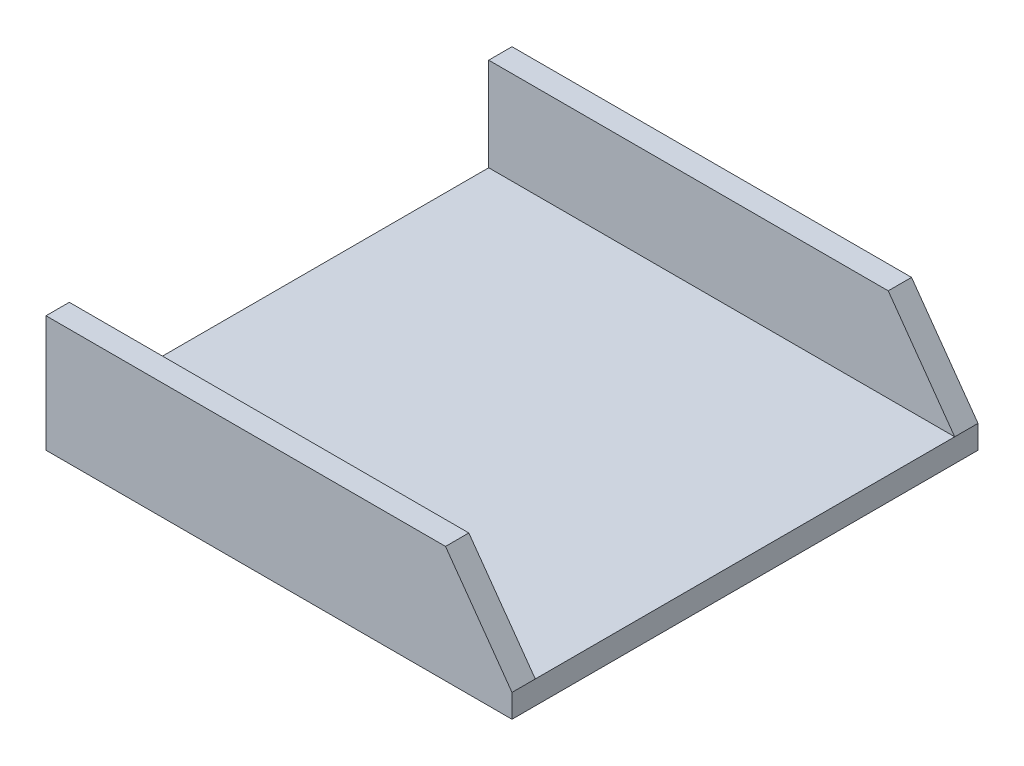
ISO-10303-21;
HEADER;
FILE_DESCRIPTION(('STEP AP214'),'2;1');
FILE_NAME('part.step','',(''),(''),'','','');
FILE_SCHEMA(('AUTOMOTIVE_DESIGN { 1 0 10303 214 1 1 1 1 }'));
ENDSEC;
DATA;
#1=APPLICATION_CONTEXT('core data for automotive mechanical design processes');
#2=APPLICATION_PROTOCOL_DEFINITION('international standard','automotive_design',2000,#1);
#3=PRODUCT_CONTEXT('',#1,'mechanical');
#4=PRODUCT('Part','Part','',(#3));
#5=PRODUCT_RELATED_PRODUCT_CATEGORY('part','',(#4));
#6=PRODUCT_DEFINITION_FORMATION('','',#4);
#7=PRODUCT_DEFINITION_CONTEXT('part definition',#1,'design');
#8=PRODUCT_DEFINITION('design','',#6,#7);
#9=PRODUCT_DEFINITION_SHAPE('','',#8);
#10=(LENGTH_UNIT() NAMED_UNIT(*) SI_UNIT(.MILLI.,.METRE.));
#11=(NAMED_UNIT(*) PLANE_ANGLE_UNIT() SI_UNIT($,.RADIAN.));
#12=(NAMED_UNIT(*) SI_UNIT($,.STERADIAN.) SOLID_ANGLE_UNIT());
#13=UNCERTAINTY_MEASURE_WITH_UNIT(LENGTH_MEASURE(1.E-05),#10,'distance_accuracy_value','');
#14=(GEOMETRIC_REPRESENTATION_CONTEXT(3) GLOBAL_UNCERTAINTY_ASSIGNED_CONTEXT((#13)) GLOBAL_UNIT_ASSIGNED_CONTEXT((#10,
#11,#12)) REPRESENTATION_CONTEXT('',''));
#15=CARTESIAN_POINT('',(0.,0.,0.));
#16=DIRECTION('',(0.,0.,1.));
#17=DIRECTION('',(1.,0.,0.));
#18=AXIS2_PLACEMENT_3D('',#15,#16,#17);
#19=CARTESIAN_POINT('',(600.,0.,0.));
#20=DIRECTION('',(0.,0.,-1.));
#21=DIRECTION('',(-1.,0.,0.));
#22=AXIS2_PLACEMENT_3D('',#19,#20,#21);
#23=PLANE('',#22);
#24=DIRECTION('',(0.58067923117328,-0.814132440383018,0.));
#25=VECTOR('',#24,1.);
#26=CARTESIAN_POINT('',(614.182493986645,10.1156510854797,0.));
#27=LINE('',#26,#25);
#28=CARTESIAN_POINT('',(514.410107883662,150.,0.));
#29=VERTEX_POINT('',#28);
#30=CARTESIAN_POINT('',(600.,30.,0.));
#31=VERTEX_POINT('',#30);
#32=EDGE_CURVE('E52',#29,#31,#27,.T.);
#33=ORIENTED_EDGE('',*,*,#32,.F.);
#34=DIRECTION('',(-1.,0.,0.));
#35=VECTOR('',#34,1.);
#36=CARTESIAN_POINT('',(600.,150.,0.));
#37=LINE('',#36,#35);
#38=CARTESIAN_POINT('',(0.,150.,0.));
#39=VERTEX_POINT('',#38);
#40=EDGE_CURVE('E94',#29,#39,#37,.T.);
#41=ORIENTED_EDGE('',*,*,#40,.T.);
#42=DIRECTION('',(0.,-1.,0.));
#43=VECTOR('',#42,1.);
#44=CARTESIAN_POINT('',(0.,0.,0.));
#45=LINE('',#44,#43);
#46=CARTESIAN_POINT('',(0.,0.,0.));
#47=VERTEX_POINT('',#46);
#48=EDGE_CURVE('E161',#39,#47,#45,.T.);
#49=ORIENTED_EDGE('',*,*,#48,.T.);
#50=DIRECTION('',(-1.,0.,0.));
#51=VECTOR('',#50,1.);
#52=CARTESIAN_POINT('',(600.,0.,0.));
#53=LINE('',#52,#51);
#54=CARTESIAN_POINT('',(600.,0.,0.));
#55=VERTEX_POINT('',#54);
#56=EDGE_CURVE('E146',#55,#47,#53,.T.);
#57=ORIENTED_EDGE('',*,*,#56,.F.);
#58=DIRECTION('',(0.,-1.,0.));
#59=VECTOR('',#58,1.);
#60=CARTESIAN_POINT('',(600.,0.,0.));
#61=LINE('',#60,#59);
#62=EDGE_CURVE('E99',#31,#55,#61,.T.);
#63=ORIENTED_EDGE('',*,*,#62,.F.);
#64=EDGE_LOOP('',(#33,#41,#49,#57,#63));
#65=FACE_BOUND('',#64,.T.);
#66=ADVANCED_FACE('F38',(#65),#23,.F.);
#67=CARTESIAN_POINT('',(600.,0.,-600.));
#68=DIRECTION('',(0.,0.,1.));
#69=DIRECTION('',(1.,0.,0.));
#70=AXIS2_PLACEMENT_3D('',#67,#68,#69);
#71=PLANE('',#70);
#72=DIRECTION('',(-0.58067923117328,0.814132440383018,0.));
#73=VECTOR('',#72,1.);
#74=CARTESIAN_POINT('',(614.182493986645,10.1156510854797,-600.));
#75=LINE('',#74,#73);
#76=CARTESIAN_POINT('',(600.,30.,-600.));
#77=VERTEX_POINT('',#76);
#78=CARTESIAN_POINT('',(514.410107883662,150.,-600.));
#79=VERTEX_POINT('',#78);
#80=EDGE_CURVE('E115',#77,#79,#75,.T.);
#81=ORIENTED_EDGE('',*,*,#80,.F.);
#82=DIRECTION('',(0.,1.,0.));
#83=VECTOR('',#82,1.);
#84=CARTESIAN_POINT('',(600.,0.,-600.));
#85=LINE('',#84,#83);
#86=CARTESIAN_POINT('',(600.,0.,-600.));
#87=VERTEX_POINT('',#86);
#88=EDGE_CURVE('E222',#87,#77,#85,.T.);
#89=ORIENTED_EDGE('',*,*,#88,.F.);
#90=DIRECTION('',(-1.,0.,0.));
#91=VECTOR('',#90,1.);
#92=CARTESIAN_POINT('',(600.,0.,-600.));
#93=LINE('',#92,#91);
#94=CARTESIAN_POINT('',(0.,0.,-600.));
#95=VERTEX_POINT('',#94);
#96=EDGE_CURVE('E142',#87,#95,#93,.T.);
#97=ORIENTED_EDGE('',*,*,#96,.T.);
#98=DIRECTION('',(0.,1.,0.));
#99=VECTOR('',#98,1.);
#100=CARTESIAN_POINT('',(0.,0.,-600.));
#101=LINE('',#100,#99);
#102=CARTESIAN_POINT('',(0.,150.,-600.));
#103=VERTEX_POINT('',#102);
#104=EDGE_CURVE('E139',#95,#103,#101,.T.);
#105=ORIENTED_EDGE('',*,*,#104,.T.);
#106=DIRECTION('',(-1.,0.,0.));
#107=VECTOR('',#106,1.);
#108=CARTESIAN_POINT('',(600.,150.,-600.));
#109=LINE('',#108,#107);
#110=EDGE_CURVE('E129',#79,#103,#109,.T.);
#111=ORIENTED_EDGE('',*,*,#110,.F.);
#112=EDGE_LOOP('',(#81,#89,#97,#105,#111));
#113=FACE_BOUND('',#112,.T.);
#114=ADVANCED_FACE('F136',(#113),#71,.F.);
#115=CARTESIAN_POINT('',(600.,150.,-570.));
#116=DIRECTION('',(0.,-1.,0.));
#117=DIRECTION('',(0.,0.,-1.));
#118=AXIS2_PLACEMENT_3D('',#115,#116,#117);
#119=PLANE('',#118);
#120=DIRECTION('',(0.,0.,1.));
#121=VECTOR('',#120,1.);
#122=CARTESIAN_POINT('',(514.410107883662,150.,-630.));
#123=LINE('',#122,#121);
#124=CARTESIAN_POINT('',(514.410107883662,150.,-570.));
#125=VERTEX_POINT('',#124);
#126=EDGE_CURVE('E118',#79,#125,#123,.T.);
#127=ORIENTED_EDGE('',*,*,#126,.F.);
#128=ORIENTED_EDGE('',*,*,#110,.T.);
#129=DIRECTION('',(0.,0.,1.));
#130=VECTOR('',#129,1.);
#131=CARTESIAN_POINT('',(0.,150.,-570.));
#132=LINE('',#131,#130);
#133=CARTESIAN_POINT('',(0.,150.,-570.));
#134=VERTEX_POINT('',#133);
#135=EDGE_CURVE('E176',#103,#134,#132,.T.);
#136=ORIENTED_EDGE('',*,*,#135,.T.);
#137=DIRECTION('',(-1.,0.,0.));
#138=VECTOR('',#137,1.);
#139=CARTESIAN_POINT('',(600.,150.,-570.));
#140=LINE('',#139,#138);
#141=EDGE_CURVE('E131',#125,#134,#140,.T.);
#142=ORIENTED_EDGE('',*,*,#141,.F.);
#143=EDGE_LOOP('',(#127,#128,#136,#142));
#144=FACE_BOUND('',#143,.T.);
#145=ADVANCED_FACE('F127',(#144),#119,.F.);
#146=CARTESIAN_POINT('',(600.,30.,-570.));
#147=DIRECTION('',(0.,0.,-1.));
#148=DIRECTION('',(-1.,0.,0.));
#149=AXIS2_PLACEMENT_3D('',#146,#147,#148);
#150=PLANE('',#149);
#151=DIRECTION('',(0.58067923117328,-0.814132440383018,0.));
#152=VECTOR('',#151,1.);
#153=CARTESIAN_POINT('',(600.,30.,-570.));
#154=LINE('',#153,#152);
#155=CARTESIAN_POINT('',(600.,30.,-570.));
#156=VERTEX_POINT('',#155);
#157=EDGE_CURVE('E61',#125,#156,#154,.T.);
#158=ORIENTED_EDGE('',*,*,#157,.F.);
#159=ORIENTED_EDGE('',*,*,#141,.T.);
#160=DIRECTION('',(0.,-1.,0.));
#161=VECTOR('',#160,1.);
#162=CARTESIAN_POINT('',(0.,30.,-570.));
#163=LINE('',#162,#161);
#164=CARTESIAN_POINT('',(0.,30.,-570.));
#165=VERTEX_POINT('',#164);
#166=EDGE_CURVE('E179',#134,#165,#163,.T.);
#167=ORIENTED_EDGE('',*,*,#166,.T.);
#168=DIRECTION('',(-1.,0.,0.));
#169=VECTOR('',#168,1.);
#170=CARTESIAN_POINT('',(600.,30.,-570.));
#171=LINE('',#170,#169);
#172=EDGE_CURVE('E148',#156,#165,#171,.T.);
#173=ORIENTED_EDGE('',*,*,#172,.F.);
#174=EDGE_LOOP('',(#158,#159,#167,#173));
#175=FACE_BOUND('',#174,.T.);
#176=ADVANCED_FACE('F241',(#175),#150,.F.);
#177=CARTESIAN_POINT('',(600.,150.,-30.));
#178=DIRECTION('',(0.,0.,1.));
#179=DIRECTION('',(0.,-1.,0.));
#180=AXIS2_PLACEMENT_3D('',#177,#178,#179);
#181=PLANE('',#180);
#182=DIRECTION('',(-0.58067923117328,0.814132440383018,0.));
#183=VECTOR('',#182,1.);
#184=CARTESIAN_POINT('',(543.27002405342,109.537395658081,-30.));
#185=LINE('',#184,#183);
#186=CARTESIAN_POINT('',(600.,29.9999999999999,-30.));
#187=VERTEX_POINT('',#186);
#188=CARTESIAN_POINT('',(514.410107883662,150.,-30.));
#189=VERTEX_POINT('',#188);
#190=EDGE_CURVE('E133',#187,#189,#185,.T.);
#191=ORIENTED_EDGE('',*,*,#190,.F.);
#192=DIRECTION('',(-1.,0.,0.));
#193=VECTOR('',#192,1.);
#194=CARTESIAN_POINT('',(600.,30.,-30.));
#195=LINE('',#194,#193);
#196=CARTESIAN_POINT('',(0.,30.,-30.));
#197=VERTEX_POINT('',#196);
#198=EDGE_CURVE('E197',#187,#197,#195,.T.);
#199=ORIENTED_EDGE('',*,*,#198,.T.);
#200=DIRECTION('',(0.,1.,0.));
#201=VECTOR('',#200,1.);
#202=CARTESIAN_POINT('',(0.,150.,-30.));
#203=LINE('',#202,#201);
#204=CARTESIAN_POINT('',(0.,150.,-30.));
#205=VERTEX_POINT('',#204);
#206=EDGE_CURVE('E185',#197,#205,#203,.T.);
#207=ORIENTED_EDGE('',*,*,#206,.T.);
#208=DIRECTION('',(-1.,0.,0.));
#209=VECTOR('',#208,1.);
#210=CARTESIAN_POINT('',(600.,150.,-30.));
#211=LINE('',#210,#209);
#212=EDGE_CURVE('E194',#189,#205,#211,.T.);
#213=ORIENTED_EDGE('',*,*,#212,.F.);
#214=EDGE_LOOP('',(#191,#199,#207,#213));
#215=FACE_BOUND('',#214,.T.);
#216=ADVANCED_FACE('F216',(#215),#181,.F.);
#217=CARTESIAN_POINT('',(600.,150.,0.));
#218=DIRECTION('',(0.,-1.,0.));
#219=DIRECTION('',(0.,0.,-1.));
#220=AXIS2_PLACEMENT_3D('',#217,#218,#219);
#221=PLANE('',#220);
#222=EDGE_CURVE('E134',#189,#29,#123,.T.);
#223=ORIENTED_EDGE('',*,*,#222,.F.);
#224=ORIENTED_EDGE('',*,*,#212,.T.);
#225=DIRECTION('',(0.,0.,1.));
#226=VECTOR('',#225,1.);
#227=CARTESIAN_POINT('',(0.,150.,0.));
#228=LINE('',#227,#226);
#229=EDGE_CURVE('E189',#205,#39,#228,.T.);
#230=ORIENTED_EDGE('',*,*,#229,.T.);
#231=ORIENTED_EDGE('',*,*,#40,.F.);
#232=EDGE_LOOP('',(#223,#224,#230,#231));
#233=FACE_BOUND('',#232,.T.);
#234=ADVANCED_FACE('F233',(#233),#221,.F.);
#235=CARTESIAN_POINT('',(600.,0.,0.));
#236=DIRECTION('',(-1.,0.,0.));
#237=DIRECTION('',(0.,0.,1.));
#238=AXIS2_PLACEMENT_3D('',#235,#236,#237);
#239=PLANE('',#238);
#240=DIRECTION('',(0.,0.,-1.));
#241=VECTOR('',#240,1.);
#242=CARTESIAN_POINT('',(600.,29.9999999999999,0.));
#243=LINE('',#242,#241);
#244=EDGE_CURVE('E11',#31,#187,#243,.T.);
#245=ORIENTED_EDGE('',*,*,#244,.F.);
#246=ORIENTED_EDGE('',*,*,#62,.T.);
#247=DIRECTION('',(0.,0.,-1.));
#248=VECTOR('',#247,1.);
#249=CARTESIAN_POINT('',(600.,0.,0.));
#250=LINE('',#249,#248);
#251=EDGE_CURVE('E159',#55,#87,#250,.T.);
#252=ORIENTED_EDGE('',*,*,#251,.T.);
#253=ORIENTED_EDGE('',*,*,#88,.T.);
#254=EDGE_CURVE('E41',#156,#77,#243,.T.);
#255=ORIENTED_EDGE('',*,*,#254,.F.);
#256=DIRECTION('',(0.,0.,1.));
#257=VECTOR('',#256,1.);
#258=CARTESIAN_POINT('',(600.,30.,-30.));
#259=LINE('',#258,#257);
#260=EDGE_CURVE('E171',#156,#187,#259,.T.);
#261=ORIENTED_EDGE('',*,*,#260,.T.);
#262=EDGE_LOOP('',(#245,#246,#252,#253,#255,#261));
#263=FACE_BOUND('',#262,.T.);
#264=ADVANCED_FACE('F220',(#263),#239,.F.);
#265=CARTESIAN_POINT('',(600.,0.,0.));
#266=DIRECTION('',(0.,1.,0.));
#267=DIRECTION('',(0.,0.,1.));
#268=AXIS2_PLACEMENT_3D('',#265,#266,#267);
#269=PLANE('',#268);
#270=DIRECTION('',(0.,0.,-1.));
#271=VECTOR('',#270,1.);
#272=CARTESIAN_POINT('',(0.,0.,0.));
#273=LINE('',#272,#271);
#274=EDGE_CURVE('E158',#47,#95,#273,.T.);
#275=ORIENTED_EDGE('',*,*,#274,.T.);
#276=ORIENTED_EDGE('',*,*,#96,.F.);
#277=ORIENTED_EDGE('',*,*,#251,.F.);
#278=ORIENTED_EDGE('',*,*,#56,.T.);
#279=EDGE_LOOP('',(#275,#276,#277,#278));
#280=FACE_BOUND('',#279,.T.);
#281=ADVANCED_FACE('F156',(#280),#269,.F.);
#282=CARTESIAN_POINT('',(600.,30.,-30.));
#283=DIRECTION('',(0.,-1.,0.));
#284=DIRECTION('',(0.,0.,-1.));
#285=AXIS2_PLACEMENT_3D('',#282,#283,#284);
#286=PLANE('',#285);
#287=DIRECTION('',(0.,0.,1.));
#288=VECTOR('',#287,1.);
#289=CARTESIAN_POINT('',(0.,30.,-30.));
#290=LINE('',#289,#288);
#291=EDGE_CURVE('E182',#165,#197,#290,.T.);
#292=ORIENTED_EDGE('',*,*,#291,.T.);
#293=ORIENTED_EDGE('',*,*,#198,.F.);
#294=ORIENTED_EDGE('',*,*,#260,.F.);
#295=ORIENTED_EDGE('',*,*,#172,.T.);
#296=EDGE_LOOP('',(#292,#293,#294,#295));
#297=FACE_BOUND('',#296,.T.);
#298=ADVANCED_FACE('F206',(#297),#286,.F.);
#299=CARTESIAN_POINT('',(0.,0.,0.));
#300=DIRECTION('',(-1.,0.,0.));
#301=DIRECTION('',(0.,0.,1.));
#302=AXIS2_PLACEMENT_3D('',#299,#300,#301);
#303=PLANE('',#302);
#304=ORIENTED_EDGE('',*,*,#48,.F.);
#305=ORIENTED_EDGE('',*,*,#229,.F.);
#306=ORIENTED_EDGE('',*,*,#206,.F.);
#307=ORIENTED_EDGE('',*,*,#291,.F.);
#308=ORIENTED_EDGE('',*,*,#166,.F.);
#309=ORIENTED_EDGE('',*,*,#135,.F.);
#310=ORIENTED_EDGE('',*,*,#104,.F.);
#311=ORIENTED_EDGE('',*,*,#274,.F.);
#312=EDGE_LOOP('',(#304,#305,#306,#307,#308,#309,#310,#311));
#313=FACE_BOUND('',#312,.T.);
#314=ADVANCED_FACE('F212',(#313),#303,.T.);
#315=CARTESIAN_POINT('',(600.,30.,-630.));
#316=DIRECTION('',(0.814132440383018,0.58067923117328,0.));
#317=DIRECTION('',(-0.58067923117328,0.814132440383018,0.));
#318=AXIS2_PLACEMENT_3D('',#315,#316,#317);
#319=PLANE('',#318);
#320=ORIENTED_EDGE('',*,*,#80,.T.);
#321=ORIENTED_EDGE('',*,*,#126,.T.);
#322=ORIENTED_EDGE('',*,*,#157,.T.);
#323=ORIENTED_EDGE('',*,*,#254,.T.);
#324=EDGE_LOOP('',(#320,#321,#322,#323));
#325=FACE_BOUND('',#324,.T.);
#326=ADVANCED_FACE('F117',(#325),#319,.T.);
#327=ORIENTED_EDGE('',*,*,#32,.T.);
#328=ORIENTED_EDGE('',*,*,#244,.T.);
#329=ORIENTED_EDGE('',*,*,#190,.T.);
#330=ORIENTED_EDGE('',*,*,#222,.T.);
#331=EDGE_LOOP('',(#327,#328,#329,#330));
#332=FACE_BOUND('',#331,.T.);
#333=ADVANCED_FACE('F231',(#332),#319,.T.);
#334=CLOSED_SHELL('',(#66,#114,#145,#176,#216,#234,#264,#281,#298,#314,#326,#333));
#335=MANIFOLD_SOLID_BREP('B2',#334);
#336=ADVANCED_BREP_SHAPE_REPRESENTATION('',(#18,#335),#14);
#337=SHAPE_DEFINITION_REPRESENTATION(#9,#336);
ENDSEC;
END-ISO-10303-21;
